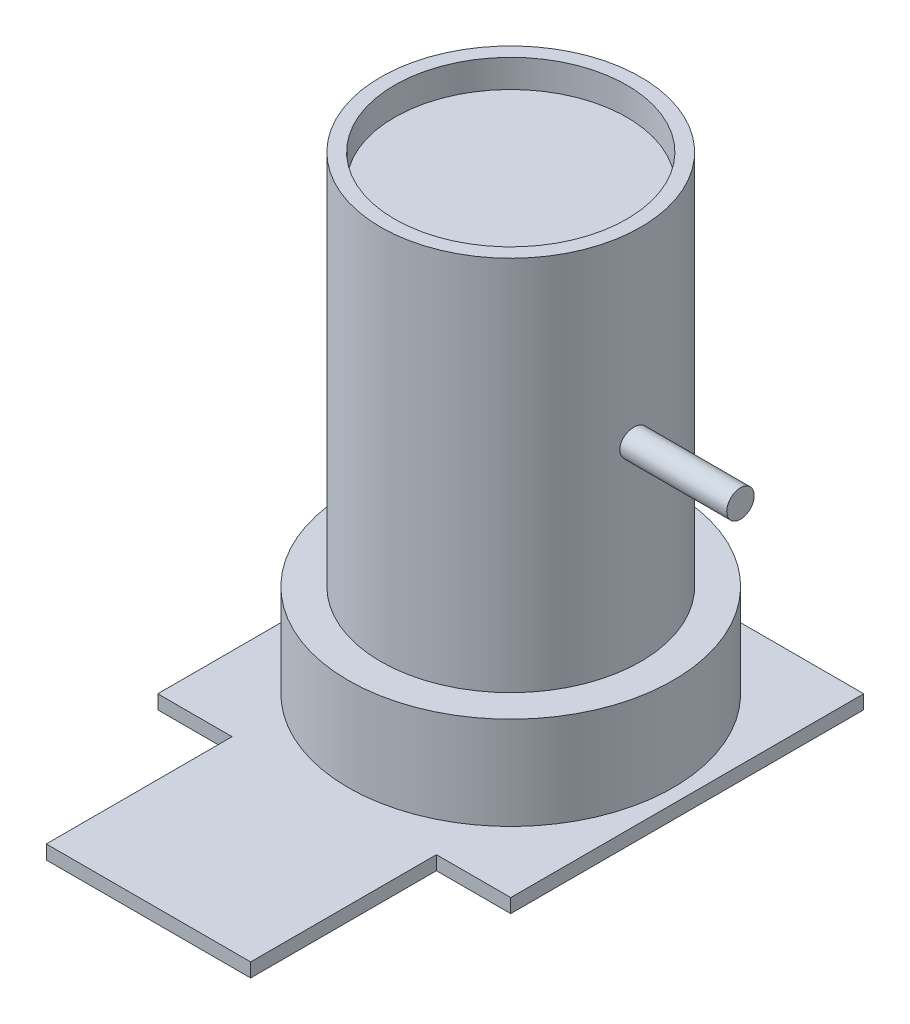
ISO-10303-21;
HEADER;
FILE_DESCRIPTION(('STEP AP214'),'2;1');
FILE_NAME('part.step','',(''),(''),'','','');
FILE_SCHEMA(('AUTOMOTIVE_DESIGN { 1 0 10303 214 1 1 1 1 }'));
ENDSEC;
DATA;
#1=APPLICATION_CONTEXT('core data for automotive mechanical design processes');
#2=APPLICATION_PROTOCOL_DEFINITION('international standard','automotive_design',2000,#1);
#3=PRODUCT_CONTEXT('',#1,'mechanical');
#4=PRODUCT('Part','Part','',(#3));
#5=PRODUCT_RELATED_PRODUCT_CATEGORY('part','',(#4));
#6=PRODUCT_DEFINITION_FORMATION('','',#4);
#7=PRODUCT_DEFINITION_CONTEXT('part definition',#1,'design');
#8=PRODUCT_DEFINITION('design','',#6,#7);
#9=PRODUCT_DEFINITION_SHAPE('','',#8);
#10=(LENGTH_UNIT() NAMED_UNIT(*) SI_UNIT(.MILLI.,.METRE.));
#11=(NAMED_UNIT(*) PLANE_ANGLE_UNIT() SI_UNIT($,.RADIAN.));
#12=(NAMED_UNIT(*) SI_UNIT($,.STERADIAN.) SOLID_ANGLE_UNIT());
#13=UNCERTAINTY_MEASURE_WITH_UNIT(LENGTH_MEASURE(1.E-05),#10,'distance_accuracy_value','');
#14=(GEOMETRIC_REPRESENTATION_CONTEXT(3) GLOBAL_UNCERTAINTY_ASSIGNED_CONTEXT((#13)) GLOBAL_UNIT_ASSIGNED_CONTEXT((#10,
#11,#12)) REPRESENTATION_CONTEXT('',''));
#15=CARTESIAN_POINT('',(0.,0.,0.));
#16=DIRECTION('',(0.,0.,1.));
#17=DIRECTION('',(1.,0.,0.));
#18=AXIS2_PLACEMENT_3D('',#15,#16,#17);
#19=CARTESIAN_POINT('',(-24.3589743589744,1.5,11.8141025641026));
#20=DIRECTION('',(0.,0.,-1.));
#21=DIRECTION('',(-1.,0.,0.));
#22=AXIS2_PLACEMENT_3D('',#19,#20,#21);
#23=PLANE('',#22);
#24=DIRECTION('',(0.,1.,0.));
#25=VECTOR('',#24,1.);
#26=CARTESIAN_POINT('',(5.64102564102564,0.,11.8141025641026));
#27=LINE('',#26,#25);
#28=CARTESIAN_POINT('',(5.64102564102564,0.,11.8141025641026));
#29=VERTEX_POINT('',#28);
#30=CARTESIAN_POINT('',(5.64102564102564,1.5,11.8141025641026));
#31=VERTEX_POINT('',#30);
#32=EDGE_CURVE('E137',#29,#31,#27,.T.);
#33=ORIENTED_EDGE('',*,*,#32,.F.);
#34=DIRECTION('',(1.,0.,0.));
#35=VECTOR('',#34,1.);
#36=CARTESIAN_POINT('',(-24.3589743589744,0.,11.8141025641026));
#37=LINE('',#36,#35);
#38=CARTESIAN_POINT('',(13.6410256410256,0.,11.8141025641026));
#39=VERTEX_POINT('',#38);
#40=EDGE_CURVE('E194',#29,#39,#37,.T.);
#41=ORIENTED_EDGE('',*,*,#40,.T.);
#42=DIRECTION('',(0.,-1.,0.));
#43=VECTOR('',#42,1.);
#44=CARTESIAN_POINT('',(13.6410256410256,1.5,11.8141025641026));
#45=LINE('',#44,#43);
#46=CARTESIAN_POINT('',(13.6410256410256,1.5,11.8141025641026));
#47=VERTEX_POINT('',#46);
#48=EDGE_CURVE('E210',#47,#39,#45,.T.);
#49=ORIENTED_EDGE('',*,*,#48,.F.);
#50=DIRECTION('',(1.,0.,0.));
#51=VECTOR('',#50,1.);
#52=CARTESIAN_POINT('',(-24.3589743589744,1.5,11.8141025641026));
#53=LINE('',#52,#51);
#54=EDGE_CURVE('E66',#31,#47,#53,.T.);
#55=ORIENTED_EDGE('',*,*,#54,.F.);
#56=EDGE_LOOP('',(#33,#41,#49,#55));
#57=FACE_BOUND('',#56,.T.);
#58=ADVANCED_FACE('F45',(#57),#23,.F.);
#59=DIRECTION('',(0.,-1.,0.));
#60=VECTOR('',#59,1.);
#61=CARTESIAN_POINT('',(-16.3589743589744,1.5,11.8141025641026));
#62=LINE('',#61,#60);
#63=CARTESIAN_POINT('',(-16.3589743589744,1.5,11.8141025641026));
#64=VERTEX_POINT('',#63);
#65=CARTESIAN_POINT('',(-16.3589743589744,0.,11.8141025641026));
#66=VERTEX_POINT('',#65);
#67=EDGE_CURVE('E74',#64,#66,#62,.T.);
#68=ORIENTED_EDGE('',*,*,#67,.F.);
#69=CARTESIAN_POINT('',(-24.3589743589744,1.5,11.8141025641026));
#70=VERTEX_POINT('',#69);
#71=EDGE_CURVE('E141',#70,#64,#53,.T.);
#72=ORIENTED_EDGE('',*,*,#71,.F.);
#73=DIRECTION('',(0.,-1.,0.));
#74=VECTOR('',#73,1.);
#75=CARTESIAN_POINT('',(-24.3589743589744,1.5,11.8141025641026));
#76=LINE('',#75,#74);
#77=CARTESIAN_POINT('',(-24.3589743589744,0.,11.8141025641026));
#78=VERTEX_POINT('',#77);
#79=EDGE_CURVE('E177',#70,#78,#76,.T.);
#80=ORIENTED_EDGE('',*,*,#79,.T.);
#81=EDGE_CURVE('E195',#78,#66,#37,.T.);
#82=ORIENTED_EDGE('',*,*,#81,.T.);
#83=EDGE_LOOP('',(#68,#72,#80,#82));
#84=FACE_BOUND('',#83,.T.);
#85=ADVANCED_FACE('F216',(#84),#23,.F.);
#86=CARTESIAN_POINT('',(-5.35897435897436,52.,-7.18589743589743));
#87=DIRECTION('',(0.,-1.,0.));
#88=DIRECTION('',(0.,0.,-1.));
#89=AXIS2_PLACEMENT_3D('',#86,#87,#88);
#90=CYLINDRICAL_SURFACE('',#89,14.);
#91=CARTESIAN_POINT('',(-5.35897435897436,52.,-7.18589743589743));
#92=DIRECTION('',(0.,1.,0.));
#93=DIRECTION('',(0.,0.,1.));
#94=AXIS2_PLACEMENT_3D('',#91,#92,#93);
#95=CIRCLE('',#94,14.);
#96=CARTESIAN_POINT('',(-5.35897435897436,52.,6.81410256410257));
#97=VERTEX_POINT('',#96);
#98=EDGE_CURVE('E158',#97,#97,#95,.T.);
#99=ORIENTED_EDGE('',*,*,#98,.F.);
#100=EDGE_LOOP('',(#99));
#101=FACE_BOUND('',#100,.T.);
#102=CARTESIAN_POINT('',(-5.35897435897436,11.5,-7.18589743589743));
#103=DIRECTION('',(0.,1.,0.));
#104=DIRECTION('',(0.,0.,1.));
#105=AXIS2_PLACEMENT_3D('',#102,#103,#104);
#106=CIRCLE('',#105,14.);
#107=CARTESIAN_POINT('',(-5.35897435897436,11.5,6.81410256410257));
#108=VERTEX_POINT('',#107);
#109=EDGE_CURVE('E59',#108,#108,#106,.T.);
#110=ORIENTED_EDGE('',*,*,#109,.T.);
#111=EDGE_LOOP('',(#110));
#112=FACE_BOUND('',#111,.T.);
#113=CARTESIAN_POINT('',(8.48173158849778,32.23,-5.07998697350609));
#114=CARTESIAN_POINT('',(8.48173278323669,32.1475104612169,-5.07999059762322));
#115=CARTESIAN_POINT('',(8.48279104447036,32.0649667887459,-5.08691397388089));
#116=CARTESIAN_POINT('',(8.486933533083,31.9021782931978,-5.1144195880058));
#117=CARTESIAN_POINT('',(8.49001997566715,31.8219360839325,-5.13501676081818));
#118=CARTESIAN_POINT('',(8.49794089707103,31.666139906384,-5.18923888819992));
#119=CARTESIAN_POINT('',(8.50277401064073,31.5905823303421,-5.22285366928351));
#120=CARTESIAN_POINT('',(8.51376829874303,31.446202834664,-5.30212336717633));
#121=CARTESIAN_POINT('',(8.51992924174001,31.3773797437636,-5.34777618520444));
#122=CARTESIAN_POINT('',(8.53310858973397,31.2478830495554,-5.45018236002261));
#123=CARTESIAN_POINT('',(8.54013253102771,31.1872679328653,-5.50700895996397));
#124=CARTESIAN_POINT('',(8.55443440705251,31.0763988681275,-5.62997944358717));
#125=CARTESIAN_POINT('',(8.56171236078843,31.0261456972979,-5.69612402555652));
#126=CARTESIAN_POINT('',(8.57601532937443,30.9370592823322,-5.83642939761301));
#127=CARTESIAN_POINT('',(8.58303806029117,30.8983137574357,-5.91064615151162));
#128=CARTESIAN_POINT('',(8.59626402532831,30.8338623618121,-6.06461004874098));
#129=CARTESIAN_POINT('',(8.60246726977033,30.808156326838,-6.14435712239675));
#130=CARTESIAN_POINT('',(8.61364430767821,30.7705919758848,-6.30694941012727));
#131=CARTESIAN_POINT('',(8.6186207587308,30.7587035156328,-6.38978747159229));
#132=CARTESIAN_POINT('',(8.62711264602274,30.7490548967528,-6.55635592081625));
#133=CARTESIAN_POINT('',(8.63062814813077,30.7512941010881,-6.64008626817078));
#134=CARTESIAN_POINT('',(8.63609809656398,30.7698020490847,-6.80544323774218));
#135=CARTESIAN_POINT('',(8.63806320472925,30.7859733437697,-6.88708042545756));
#136=CARTESIAN_POINT('',(8.64055891280554,30.8317696090981,-7.04651191945819));
#137=CARTESIAN_POINT('',(8.6410895304887,30.8613944130585,-7.12430627334122));
#138=CARTESIAN_POINT('',(8.64094953428407,30.9331666383539,-7.27364518792047));
#139=CARTESIAN_POINT('',(8.64028188802381,30.9752829076797,-7.34520472969669));
#140=CARTESIAN_POINT('',(8.63809365607185,31.0708721305932,-7.48027265004516));
#141=CARTESIAN_POINT('',(8.63657305475389,31.1243452922299,-7.54378088108996));
#142=CARTESIAN_POINT('',(8.63308084898166,31.2413164952197,-7.66114037351345));
#143=CARTESIAN_POINT('',(8.63110791439204,31.3048439281544,-7.71496230110198));
#144=CARTESIAN_POINT('',(8.62713736007906,31.4400178599744,-7.81120240095022));
#145=CARTESIAN_POINT('',(8.62513974005873,31.511664456613,-7.85362043588816));
#146=CARTESIAN_POINT('',(8.62149989626798,31.6612302878015,-7.92593798597908));
#147=CARTESIAN_POINT('',(8.61985849001027,31.7391633997159,-7.95580884913525));
#148=CARTESIAN_POINT('',(8.6172359017642,31.8989495455192,-8.00203921968996));
#149=CARTESIAN_POINT('',(8.61625471292774,31.9808025387398,-8.01839886723374));
#150=CARTESIAN_POINT('',(8.61512669037365,32.1459985046115,-8.03712572425917));
#151=CARTESIAN_POINT('',(8.61497884152573,32.2293395403435,-8.03950995798546));
#152=CARTESIAN_POINT('',(8.61554056971209,32.3952370558939,-8.03026290059696));
#153=CARTESIAN_POINT('',(8.61625014293073,32.477793539202,-8.01863167185283));
#154=CARTESIAN_POINT('',(8.61840113620907,32.6396947592593,-7.98170654008215));
#155=CARTESIAN_POINT('',(8.61984182723082,32.719042610578,-7.95642624569149));
#156=CARTESIAN_POINT('',(8.62319668785912,32.8723723178466,-7.89293181000052));
#157=CARTESIAN_POINT('',(8.62511086398039,32.9463540999462,-7.85471749073713));
#158=CARTESIAN_POINT('',(8.62905640883219,33.0869738939246,-7.76636797225466));
#159=CARTESIAN_POINT('',(8.6310879511785,33.1536005787653,-7.71621475160205));
#160=CARTESIAN_POINT('',(8.63484759260458,33.2774985606782,-7.60543359903037));
#161=CARTESIAN_POINT('',(8.63657569035299,33.3347698167032,-7.54480562115547));
#162=CARTESIAN_POINT('',(8.63930582019399,33.4383569233178,-7.41475547230075));
#163=CARTESIAN_POINT('',(8.64030750509958,33.4846675281809,-7.34532911475707));
#164=CARTESIAN_POINT('',(8.64120800268319,33.5649735087793,-7.19967971425036));
#165=CARTESIAN_POINT('',(8.64110684375198,33.5989692015168,-7.12345684630153));
#166=CARTESIAN_POINT('',(8.63952734444022,33.6535901608173,-6.96663723416104));
#167=CARTESIAN_POINT('',(8.63805321337168,33.6742559670537,-6.88605456733979));
#168=CARTESIAN_POINT('',(8.63359667194314,33.7018044436844,-6.72260858015421));
#169=CARTESIAN_POINT('',(8.63061428589047,33.7086873361982,-6.63974529656511));
#170=CARTESIAN_POINT('',(8.62317258694322,33.7085020190139,-6.47427055447317));
#171=CARTESIAN_POINT('',(8.61871626169598,33.7014618884512,-6.39165892496048));
#172=CARTESIAN_POINT('',(8.60851309667064,33.673723512495,-6.22884434248877));
#173=CARTESIAN_POINT('',(8.60276622184126,33.6530248961081,-6.14864145501816));
#174=CARTESIAN_POINT('',(8.59029324047084,33.5984695176276,-5.99254307196799));
#175=CARTESIAN_POINT('',(8.58356310176334,33.5645575667582,-5.91666719338861));
#176=CARTESIAN_POINT('',(8.56960499493209,33.4845507575636,-5.77168818636803));
#177=CARTESIAN_POINT('',(8.56237701938741,33.4384557176041,-5.70258515892247));
#178=CARTESIAN_POINT('',(8.54791785707406,33.3350197058136,-5.57262147222674));
#179=CARTESIAN_POINT('',(8.54068696594304,33.2776062905613,-5.51181841914672));
#180=CARTESIAN_POINT('',(8.52685298422522,33.1533061455364,-5.40069625607101));
#181=CARTESIAN_POINT('',(8.52025003805962,33.0864172452588,-5.35037955467879));
#182=CARTESIAN_POINT('',(8.50823240642277,32.9450343744981,-5.26168690261402));
#183=CARTESIAN_POINT('',(8.50281792657955,32.870539091223,-5.22331301780427));
#184=CARTESIAN_POINT('',(8.49366178284952,32.7161106217542,-5.15969043518753));
#185=CARTESIAN_POINT('',(8.48991816604937,32.636183910467,-5.13442640886076));
#186=CARTESIAN_POINT('',(8.48538391830745,32.5014935497679,-5.10409969086942));
#187=CARTESIAN_POINT('',(8.48401952102312,32.4476090876035,-5.0950703138589));
#188=CARTESIAN_POINT('',(8.48219296511559,32.3391576488059,-5.08301278477688));
#189=CARTESIAN_POINT('',(8.48173079783258,32.2845906787287,-5.07998457510483));
#190=CARTESIAN_POINT('',(8.48173158849778,32.23,-5.07998697350609));
#191=B_SPLINE_CURVE_WITH_KNOTS('',3,(#113,#114,#115,#116,#117,#118,#119,#120,#121,#122,#123,
#124,#125,#126,#127,#128,#129,#130,#131,#132,#133,#134,#135,#136,#137,#138,#139,#140,#141,#142,
#143,#144,#145,#146,#147,#148,#149,#150,#151,#152,#153,#154,#155,#156,#157,#158,#159,#160,#161,
#162,#163,#164,#165,#166,#167,#168,#169,#170,#171,#172,#173,#174,#175,#176,#177,#178,#179,#180,
#181,#182,#183,#184,#185,#186,#187,#188,#189,#190),.UNSPECIFIED.,.T.,.F.,(4,2,2,2,2,2,2,2,2,2,2,
2,2,2,2,2,2,2,2,2,2,2,2,2,2,2,2,2,2,2,2,2,2,2,2,2,2,2,4),(0.,0.247268478376293,
0.494807476382064,0.742153407527307,0.989456243429718,1.2384376821803,1.48743778948063,
1.73828991099942,1.98913887267552,2.23943955160999,2.48972894420787,2.73828175340992,
2.98683148323608,3.23476650251306,3.48270606414774,3.731384289064,3.98006550834403,
4.22931155447024,4.47855501525666,4.72749479523854,4.97643346740932,5.22512439540225,
5.47381874534654,5.72289089974197,5.97196414691799,6.2211563596471,6.47034215737933,
6.71876649743278,6.967186833958,7.21510668182274,7.46303326399491,7.71200666940843,
7.96098378690697,8.21160949436877,8.46229270459968,8.71301925382386,8.96345198018459,
9.12709313791047,9.29073272496463),.UNSPECIFIED.);
#192=CARTESIAN_POINT('',(8.48173158849778,32.23,-5.07998697350609));
#193=VERTEX_POINT('',#192);
#194=EDGE_CURVE('E11',#193,#193,#191,.T.);
#195=ORIENTED_EDGE('',*,*,#194,.F.);
#196=EDGE_LOOP('',(#195));
#197=FACE_BOUND('',#196,.T.);
#198=ADVANCED_FACE('F266',(#101,#112,#197),#90,.T.);
#199=CARTESIAN_POINT('',(-24.3589743589744,1.5,-26.1858974358974));
#200=DIRECTION('',(1.,0.,0.));
#201=DIRECTION('',(0.,0.,-1.));
#202=AXIS2_PLACEMENT_3D('',#199,#200,#201);
#203=PLANE('',#202);
#204=DIRECTION('',(0.,0.,1.));
#205=VECTOR('',#204,1.);
#206=CARTESIAN_POINT('',(-24.3589743589744,0.,-26.1858974358974));
#207=LINE('',#206,#205);
#208=CARTESIAN_POINT('',(-24.3589743589744,0.,-26.1858974358974));
#209=VERTEX_POINT('',#208);
#210=EDGE_CURVE('E173',#209,#78,#207,.T.);
#211=ORIENTED_EDGE('',*,*,#210,.T.);
#212=ORIENTED_EDGE('',*,*,#79,.F.);
#213=DIRECTION('',(0.,0.,1.));
#214=VECTOR('',#213,1.);
#215=CARTESIAN_POINT('',(-24.3589743589744,1.5,-26.1858974358974));
#216=LINE('',#215,#214);
#217=CARTESIAN_POINT('',(-24.3589743589744,1.5,-26.1858974358974));
#218=VERTEX_POINT('',#217);
#219=EDGE_CURVE('E178',#218,#70,#216,.T.);
#220=ORIENTED_EDGE('',*,*,#219,.F.);
#221=DIRECTION('',(0.,-1.,0.));
#222=VECTOR('',#221,1.);
#223=CARTESIAN_POINT('',(-24.3589743589744,1.5,-26.1858974358974));
#224=LINE('',#223,#222);
#225=EDGE_CURVE('E190',#218,#209,#224,.T.);
#226=ORIENTED_EDGE('',*,*,#225,.T.);
#227=EDGE_LOOP('',(#211,#212,#220,#226));
#228=FACE_BOUND('',#227,.T.);
#229=ADVANCED_FACE('F47',(#228),#203,.F.);
#230=CARTESIAN_POINT('',(13.6410256410256,1.5,-26.1858974358974));
#231=DIRECTION('',(-1.,0.,0.));
#232=DIRECTION('',(0.,0.,1.));
#233=AXIS2_PLACEMENT_3D('',#230,#231,#232);
#234=PLANE('',#233);
#235=DIRECTION('',(0.,0.,-1.));
#236=VECTOR('',#235,1.);
#237=CARTESIAN_POINT('',(13.6410256410256,0.,-26.1858974358974));
#238=LINE('',#237,#236);
#239=CARTESIAN_POINT('',(13.6410256410256,0.,-26.1858974358974));
#240=VERTEX_POINT('',#239);
#241=EDGE_CURVE('E198',#39,#240,#238,.T.);
#242=ORIENTED_EDGE('',*,*,#241,.T.);
#243=DIRECTION('',(0.,-1.,0.));
#244=VECTOR('',#243,1.);
#245=CARTESIAN_POINT('',(13.6410256410256,1.5,-26.1858974358974));
#246=LINE('',#245,#244);
#247=CARTESIAN_POINT('',(13.6410256410256,1.5,-26.1858974358974));
#248=VERTEX_POINT('',#247);
#249=EDGE_CURVE('E206',#248,#240,#246,.T.);
#250=ORIENTED_EDGE('',*,*,#249,.F.);
#251=DIRECTION('',(0.,0.,-1.));
#252=VECTOR('',#251,1.);
#253=CARTESIAN_POINT('',(13.6410256410256,1.5,-26.1858974358974));
#254=LINE('',#253,#252);
#255=EDGE_CURVE('E184',#47,#248,#254,.T.);
#256=ORIENTED_EDGE('',*,*,#255,.F.);
#257=ORIENTED_EDGE('',*,*,#48,.T.);
#258=EDGE_LOOP('',(#242,#250,#256,#257));
#259=FACE_BOUND('',#258,.T.);
#260=ADVANCED_FACE('F246',(#259),#234,.F.);
#261=CARTESIAN_POINT('',(-24.3589743589744,1.5,-26.1858974358974));
#262=DIRECTION('',(0.,0.,1.));
#263=DIRECTION('',(1.,0.,0.));
#264=AXIS2_PLACEMENT_3D('',#261,#262,#263);
#265=PLANE('',#264);
#266=DIRECTION('',(-1.,0.,0.));
#267=VECTOR('',#266,1.);
#268=CARTESIAN_POINT('',(-24.3589743589744,0.,-26.1858974358974));
#269=LINE('',#268,#267);
#270=EDGE_CURVE('E181',#240,#209,#269,.T.);
#271=ORIENTED_EDGE('',*,*,#270,.T.);
#272=ORIENTED_EDGE('',*,*,#225,.F.);
#273=DIRECTION('',(-1.,0.,0.));
#274=VECTOR('',#273,1.);
#275=CARTESIAN_POINT('',(-24.3589743589744,1.5,-26.1858974358974));
#276=LINE('',#275,#274);
#277=EDGE_CURVE('E187',#248,#218,#276,.T.);
#278=ORIENTED_EDGE('',*,*,#277,.F.);
#279=ORIENTED_EDGE('',*,*,#249,.T.);
#280=EDGE_LOOP('',(#271,#272,#278,#279));
#281=FACE_BOUND('',#280,.T.);
#282=ADVANCED_FACE('F249',(#281),#265,.F.);
#283=CARTESIAN_POINT('',(0.,1.5,0.));
#284=DIRECTION('',(0.,1.,0.));
#285=DIRECTION('',(0.,0.,1.));
#286=AXIS2_PLACEMENT_3D('',#283,#284,#285);
#287=PLANE('',#286);
#288=CARTESIAN_POINT('',(-5.35897435897436,1.5,-7.18589743589743));
#289=DIRECTION('',(0.,1.,0.));
#290=DIRECTION('',(0.,0.,1.));
#291=AXIS2_PLACEMENT_3D('',#288,#289,#290);
#292=CIRCLE('',#291,17.5);
#293=CARTESIAN_POINT('',(-5.35897435897436,1.5,10.3141025641026));
#294=VERTEX_POINT('',#293);
#295=EDGE_CURVE('E169',#294,#294,#292,.T.);
#296=ORIENTED_EDGE('',*,*,#295,.F.);
#297=EDGE_LOOP('',(#296));
#298=FACE_BOUND('',#297,.T.);
#299=ORIENTED_EDGE('',*,*,#219,.T.);
#300=ORIENTED_EDGE('',*,*,#71,.T.);
#301=DIRECTION('',(0.,0.,-1.));
#302=VECTOR('',#301,1.);
#303=CARTESIAN_POINT('',(-16.3589743589744,1.5,31.8141025641026));
#304=LINE('',#303,#302);
#305=CARTESIAN_POINT('',(-16.3589743589744,1.5,31.8141025641026));
#306=VERTEX_POINT('',#305);
#307=EDGE_CURVE('E120',#306,#64,#304,.T.);
#308=ORIENTED_EDGE('',*,*,#307,.F.);
#309=DIRECTION('',(-1.,0.,0.));
#310=VECTOR('',#309,1.);
#311=CARTESIAN_POINT('',(5.64102564102564,1.5,31.8141025641026));
#312=LINE('',#311,#310);
#313=CARTESIAN_POINT('',(5.64102564102564,1.5,31.8141025641026));
#314=VERTEX_POINT('',#313);
#315=EDGE_CURVE('E127',#314,#306,#312,.T.);
#316=ORIENTED_EDGE('',*,*,#315,.F.);
#317=DIRECTION('',(0.,0.,-1.));
#318=VECTOR('',#317,1.);
#319=CARTESIAN_POINT('',(5.64102564102564,1.5,31.8141025641026));
#320=LINE('',#319,#318);
#321=EDGE_CURVE('E231',#314,#31,#320,.T.);
#322=ORIENTED_EDGE('',*,*,#321,.T.);
#323=ORIENTED_EDGE('',*,*,#54,.T.);
#324=ORIENTED_EDGE('',*,*,#255,.T.);
#325=ORIENTED_EDGE('',*,*,#277,.T.);
#326=EDGE_LOOP('',(#299,#300,#308,#316,#322,#323,#324,#325));
#327=FACE_BOUND('',#326,.T.);
#328=ADVANCED_FACE('F140',(#298,#327),#287,.T.);
#329=CARTESIAN_POINT('',(0.,0.,0.));
#330=DIRECTION('',(0.,1.,0.));
#331=DIRECTION('',(0.,0.,1.));
#332=AXIS2_PLACEMENT_3D('',#329,#330,#331);
#333=PLANE('',#332);
#334=ORIENTED_EDGE('',*,*,#210,.F.);
#335=ORIENTED_EDGE('',*,*,#270,.F.);
#336=ORIENTED_EDGE('',*,*,#241,.F.);
#337=ORIENTED_EDGE('',*,*,#40,.F.);
#338=DIRECTION('',(0.,0.,-1.));
#339=VECTOR('',#338,1.);
#340=CARTESIAN_POINT('',(5.64102564102564,0.,31.8141025641026));
#341=LINE('',#340,#339);
#342=CARTESIAN_POINT('',(5.64102564102564,0.,31.8141025641026));
#343=VERTEX_POINT('',#342);
#344=EDGE_CURVE('E150',#343,#29,#341,.T.);
#345=ORIENTED_EDGE('',*,*,#344,.F.);
#346=DIRECTION('',(1.,0.,0.));
#347=VECTOR('',#346,1.);
#348=CARTESIAN_POINT('',(-16.3589743589744,0.,31.8141025641026));
#349=LINE('',#348,#347);
#350=CARTESIAN_POINT('',(-16.3589743589744,0.,31.8141025641026));
#351=VERTEX_POINT('',#350);
#352=EDGE_CURVE('E126',#351,#343,#349,.T.);
#353=ORIENTED_EDGE('',*,*,#352,.F.);
#354=DIRECTION('',(0.,0.,-1.));
#355=VECTOR('',#354,1.);
#356=CARTESIAN_POINT('',(-16.3589743589744,0.,31.8141025641026));
#357=LINE('',#356,#355);
#358=EDGE_CURVE('E122',#351,#66,#357,.T.);
#359=ORIENTED_EDGE('',*,*,#358,.T.);
#360=ORIENTED_EDGE('',*,*,#81,.F.);
#361=EDGE_LOOP('',(#334,#335,#336,#337,#345,#353,#359,#360));
#362=FACE_BOUND('',#361,.T.);
#363=ADVANCED_FACE('F223',(#362),#333,.F.);
#364=CARTESIAN_POINT('',(-5.35897435897436,11.5,-7.18589743589743));
#365=DIRECTION('',(0.,-1.,0.));
#366=DIRECTION('',(0.,0.,-1.));
#367=AXIS2_PLACEMENT_3D('',#364,#365,#366);
#368=CYLINDRICAL_SURFACE('',#367,17.5);
#369=CARTESIAN_POINT('',(-5.35897435897436,11.5,-7.18589743589743));
#370=DIRECTION('',(0.,1.,0.));
#371=DIRECTION('',(0.,0.,1.));
#372=AXIS2_PLACEMENT_3D('',#369,#370,#371);
#373=CIRCLE('',#372,17.5);
#374=CARTESIAN_POINT('',(-5.35897435897436,11.5,10.3141025641026));
#375=VERTEX_POINT('',#374);
#376=EDGE_CURVE('E165',#375,#375,#373,.T.);
#377=ORIENTED_EDGE('',*,*,#376,.F.);
#378=EDGE_LOOP('',(#377));
#379=FACE_BOUND('',#378,.T.);
#380=ORIENTED_EDGE('',*,*,#295,.T.);
#381=EDGE_LOOP('',(#380));
#382=FACE_BOUND('',#381,.T.);
#383=ADVANCED_FACE('F286',(#379,#382),#368,.T.);
#384=CARTESIAN_POINT('',(-5.35897435897436,11.5,-7.18589743589743));
#385=DIRECTION('',(0.,1.,0.));
#386=DIRECTION('',(0.,0.,1.));
#387=AXIS2_PLACEMENT_3D('',#384,#385,#386);
#388=PLANE('',#387);
#389=ORIENTED_EDGE('',*,*,#109,.F.);
#390=EDGE_LOOP('',(#389));
#391=FACE_BOUND('',#390,.T.);
#392=ORIENTED_EDGE('',*,*,#376,.T.);
#393=EDGE_LOOP('',(#392));
#394=FACE_BOUND('',#393,.T.);
#395=ADVANCED_FACE('F283',(#391,#394),#388,.T.);
#396=CARTESIAN_POINT('',(-5.35897435897436,52.,-7.18589743589743));
#397=DIRECTION('',(0.,1.,0.));
#398=DIRECTION('',(0.,0.,1.));
#399=AXIS2_PLACEMENT_3D('',#396,#397,#398);
#400=PLANE('',#399);
#401=CARTESIAN_POINT('',(-5.35897435897436,52.,-7.18589743589743));
#402=DIRECTION('',(0.,1.,0.));
#403=DIRECTION('',(0.,0.,1.));
#404=AXIS2_PLACEMENT_3D('',#401,#402,#403);
#405=CIRCLE('',#404,12.5);
#406=CARTESIAN_POINT('',(-5.35897435897436,52.,5.31410256410257));
#407=VERTEX_POINT('',#406);
#408=EDGE_CURVE('E148',#407,#407,#405,.T.);
#409=ORIENTED_EDGE('',*,*,#408,.F.);
#410=EDGE_LOOP('',(#409));
#411=FACE_BOUND('',#410,.T.);
#412=ORIENTED_EDGE('',*,*,#98,.T.);
#413=EDGE_LOOP('',(#412));
#414=FACE_BOUND('',#413,.T.);
#415=ADVANCED_FACE('F281',(#411,#414),#400,.T.);
#416=CARTESIAN_POINT('',(-5.35897435897436,49.,-7.18589743589743));
#417=DIRECTION('',(0.,1.,0.));
#418=DIRECTION('',(0.,0.,1.));
#419=AXIS2_PLACEMENT_3D('',#416,#417,#418);
#420=CYLINDRICAL_SURFACE('',#419,12.5);
#421=CARTESIAN_POINT('',(-5.35897435897436,49.,-7.18589743589743));
#422=DIRECTION('',(0.,1.,0.));
#423=DIRECTION('',(0.,0.,1.));
#424=AXIS2_PLACEMENT_3D('',#421,#422,#423);
#425=CIRCLE('',#424,12.5);
#426=CARTESIAN_POINT('',(-5.35897435897436,49.,5.31410256410257));
#427=VERTEX_POINT('',#426);
#428=EDGE_CURVE('E154',#427,#427,#425,.T.);
#429=ORIENTED_EDGE('',*,*,#428,.F.);
#430=EDGE_LOOP('',(#429));
#431=FACE_BOUND('',#430,.T.);
#432=ORIENTED_EDGE('',*,*,#408,.T.);
#433=EDGE_LOOP('',(#432));
#434=FACE_BOUND('',#433,.T.);
#435=ADVANCED_FACE('F353',(#431,#434),#420,.F.);
#436=CARTESIAN_POINT('',(-5.35897435897436,49.,-7.18589743589743));
#437=DIRECTION('',(0.,1.,0.));
#438=DIRECTION('',(0.,0.,1.));
#439=AXIS2_PLACEMENT_3D('',#436,#437,#438);
#440=PLANE('',#439);
#441=ORIENTED_EDGE('',*,*,#428,.T.);
#442=EDGE_LOOP('',(#441));
#443=FACE_BOUND('',#442,.T.);
#444=ADVANCED_FACE('F341',(#443),#440,.T.);
#445=CARTESIAN_POINT('',(20.,32.23,-6.55858248725508));
#446=DIRECTION('',(-1.,0.,0.));
#447=DIRECTION('',(0.,0.,1.));
#448=AXIS2_PLACEMENT_3D('',#445,#446,#447);
#449=CYLINDRICAL_SURFACE('',#448,1.47859551374899);
#450=CARTESIAN_POINT('',(20.,32.23,-6.55858248725508));
#451=DIRECTION('',(1.,0.,0.));
#452=DIRECTION('',(0.,0.,-1.));
#453=AXIS2_PLACEMENT_3D('',#450,#451,#452);
#454=CIRCLE('',#453,1.47859551374899);
#455=CARTESIAN_POINT('',(20.,32.23,-8.03717800100406));
#456=VERTEX_POINT('',#455);
#457=EDGE_CURVE('E143',#456,#456,#454,.T.);
#458=ORIENTED_EDGE('',*,*,#457,.F.);
#459=EDGE_LOOP('',(#458));
#460=FACE_BOUND('',#459,.T.);
#461=ORIENTED_EDGE('',*,*,#194,.T.);
#462=EDGE_LOOP('',(#461));
#463=FACE_BOUND('',#462,.T.);
#464=ADVANCED_FACE('F334',(#460,#463),#449,.T.);
#465=CARTESIAN_POINT('',(20.,32.23,-6.55858248725508));
#466=DIRECTION('',(1.,0.,0.));
#467=DIRECTION('',(0.,0.,-1.));
#468=AXIS2_PLACEMENT_3D('',#465,#466,#467);
#469=PLANE('',#468);
#470=ORIENTED_EDGE('',*,*,#457,.T.);
#471=EDGE_LOOP('',(#470));
#472=FACE_BOUND('',#471,.T.);
#473=ADVANCED_FACE('F301',(#472),#469,.T.);
#474=CARTESIAN_POINT('',(-16.3589743589744,1.5,31.8141025641026));
#475=DIRECTION('',(1.,0.,0.));
#476=DIRECTION('',(0.,0.,-1.));
#477=AXIS2_PLACEMENT_3D('',#474,#475,#476);
#478=PLANE('',#477);
#479=ORIENTED_EDGE('',*,*,#67,.T.);
#480=ORIENTED_EDGE('',*,*,#358,.F.);
#481=DIRECTION('',(0.,-1.,0.));
#482=VECTOR('',#481,1.);
#483=CARTESIAN_POINT('',(-16.3589743589744,1.5,31.8141025641026));
#484=LINE('',#483,#482);
#485=EDGE_CURVE('E116',#306,#351,#484,.T.);
#486=ORIENTED_EDGE('',*,*,#485,.F.);
#487=ORIENTED_EDGE('',*,*,#307,.T.);
#488=EDGE_LOOP('',(#479,#480,#486,#487));
#489=FACE_BOUND('',#488,.T.);
#490=ADVANCED_FACE('F118',(#489),#478,.F.);
#491=CARTESIAN_POINT('',(5.64102564102564,0.,31.8141025641026));
#492=DIRECTION('',(-1.,0.,0.));
#493=DIRECTION('',(0.,0.,1.));
#494=AXIS2_PLACEMENT_3D('',#491,#492,#493);
#495=PLANE('',#494);
#496=ORIENTED_EDGE('',*,*,#32,.T.);
#497=ORIENTED_EDGE('',*,*,#321,.F.);
#498=DIRECTION('',(0.,1.,0.));
#499=VECTOR('',#498,1.);
#500=CARTESIAN_POINT('',(5.64102564102564,0.,31.8141025641026));
#501=LINE('',#500,#499);
#502=EDGE_CURVE('E132',#343,#314,#501,.T.);
#503=ORIENTED_EDGE('',*,*,#502,.F.);
#504=ORIENTED_EDGE('',*,*,#344,.T.);
#505=EDGE_LOOP('',(#496,#497,#503,#504));
#506=FACE_BOUND('',#505,.T.);
#507=ADVANCED_FACE('F241',(#506),#495,.F.);
#508=CARTESIAN_POINT('',(0.,0.,31.8141025641026));
#509=DIRECTION('',(0.,0.,1.));
#510=DIRECTION('',(1.,0.,0.));
#511=AXIS2_PLACEMENT_3D('',#508,#509,#510);
#512=PLANE('',#511);
#513=ORIENTED_EDGE('',*,*,#315,.T.);
#514=ORIENTED_EDGE('',*,*,#485,.T.);
#515=ORIENTED_EDGE('',*,*,#352,.T.);
#516=ORIENTED_EDGE('',*,*,#502,.T.);
#517=EDGE_LOOP('',(#513,#514,#515,#516));
#518=FACE_BOUND('',#517,.T.);
#519=ADVANCED_FACE('F130',(#518),#512,.T.);
#520=CLOSED_SHELL('',(#58,#85,#198,#229,#260,#282,#328,#363,#383,#395,#415,#435,#444,#464,#473,
#490,#507,#519));
#521=MANIFOLD_SOLID_BREP('B2',#520);
#522=ADVANCED_BREP_SHAPE_REPRESENTATION('',(#18,#521),#14);
#523=SHAPE_DEFINITION_REPRESENTATION(#9,#522);
ENDSEC;
END-ISO-10303-21;
